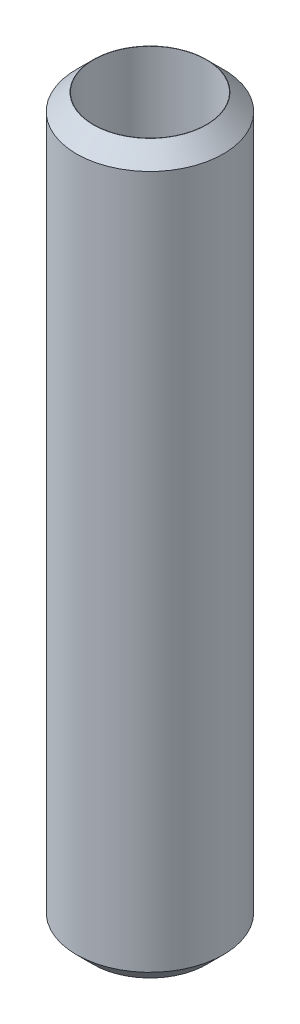
ISO-10303-21;
HEADER;
FILE_DESCRIPTION(('STEP AP214'),'2;1');
FILE_NAME('part.step','',(''),(''),'','','');
FILE_SCHEMA(('AUTOMOTIVE_DESIGN { 1 0 10303 214 1 1 1 1 }'));
ENDSEC;
DATA;
#1=APPLICATION_CONTEXT('core data for automotive mechanical design processes');
#2=APPLICATION_PROTOCOL_DEFINITION('international standard','automotive_design',2000,#1);
#3=PRODUCT_CONTEXT('',#1,'mechanical');
#4=PRODUCT('Part','Part','',(#3));
#5=PRODUCT_RELATED_PRODUCT_CATEGORY('part','',(#4));
#6=PRODUCT_DEFINITION_FORMATION('','',#4);
#7=PRODUCT_DEFINITION_CONTEXT('part definition',#1,'design');
#8=PRODUCT_DEFINITION('design','',#6,#7);
#9=PRODUCT_DEFINITION_SHAPE('','',#8);
#10=(LENGTH_UNIT() NAMED_UNIT(*) SI_UNIT(.MILLI.,.METRE.));
#11=(NAMED_UNIT(*) PLANE_ANGLE_UNIT() SI_UNIT($,.RADIAN.));
#12=(NAMED_UNIT(*) SI_UNIT($,.STERADIAN.) SOLID_ANGLE_UNIT());
#13=UNCERTAINTY_MEASURE_WITH_UNIT(LENGTH_MEASURE(1.E-05),#10,'distance_accuracy_value','');
#14=(GEOMETRIC_REPRESENTATION_CONTEXT(3) GLOBAL_UNCERTAINTY_ASSIGNED_CONTEXT((#13)) GLOBAL_UNIT_ASSIGNED_CONTEXT((#10,
#11,#12)) REPRESENTATION_CONTEXT('',''));
#15=CARTESIAN_POINT('',(0.,0.,0.));
#16=DIRECTION('',(0.,0.,1.));
#17=DIRECTION('',(1.,0.,0.));
#18=AXIS2_PLACEMENT_3D('',#15,#16,#17);
#19=CARTESIAN_POINT('',(0.,173.412976697648,0.));
#20=DIRECTION('',(0.,-1.,0.));
#21=DIRECTION('',(0.,0.,-1.));
#22=AXIS2_PLACEMENT_3D('',#19,#20,#21);
#23=CYLINDRICAL_SURFACE('',#22,17.5);
#24=CARTESIAN_POINT('',(0.,169.405689686538,0.));
#25=DIRECTION('',(0.,1.,0.));
#26=DIRECTION('',(0.,0.,1.));
#27=AXIS2_PLACEMENT_3D('',#24,#25,#26);
#28=CIRCLE('',#27,17.5);
#29=CARTESIAN_POINT('',(0.,169.405689686538,17.5));
#30=VERTEX_POINT('',#29);
#31=EDGE_CURVE('E50',#30,#30,#28,.F.);
#32=ORIENTED_EDGE('',*,*,#31,.T.);
#33=EDGE_LOOP('',(#32));
#34=FACE_BOUND('',#33,.T.);
#35=CARTESIAN_POINT('',(0.,4.00728701110975,0.));
#36=DIRECTION('',(0.,1.,0.));
#37=DIRECTION('',(0.,0.,1.));
#38=AXIS2_PLACEMENT_3D('',#35,#36,#37);
#39=CIRCLE('',#38,17.5);
#40=CARTESIAN_POINT('',(0.,4.00728701110975,17.5));
#41=VERTEX_POINT('',#40);
#42=EDGE_CURVE('E51',#41,#41,#39,.T.);
#43=ORIENTED_EDGE('',*,*,#42,.T.);
#44=EDGE_LOOP('',(#43));
#45=FACE_BOUND('',#44,.T.);
#46=ADVANCED_FACE('F39',(#34,#45),#23,.T.);
#47=CARTESIAN_POINT('',(0.,173.412976697648,0.));
#48=DIRECTION('',(0.,1.,0.));
#49=DIRECTION('',(0.,0.,1.));
#50=AXIS2_PLACEMENT_3D('',#47,#48,#49);
#51=PLANE('',#50);
#52=CARTESIAN_POINT('',(0.,173.412976697648,0.));
#53=DIRECTION('',(0.,1.,0.));
#54=DIRECTION('',(0.,0.,1.));
#55=AXIS2_PLACEMENT_3D('',#52,#53,#54);
#56=CIRCLE('',#55,13.4927129888902);
#57=CARTESIAN_POINT('',(0.,173.412976697648,13.4927129888902));
#58=VERTEX_POINT('',#57);
#59=EDGE_CURVE('E54',#58,#58,#56,.T.);
#60=ORIENTED_EDGE('',*,*,#59,.T.);
#61=EDGE_LOOP('',(#60));
#62=FACE_BOUND('',#61,.T.);
#63=CARTESIAN_POINT('',(0.,173.412976697648,0.));
#64=DIRECTION('',(0.,1.,0.));
#65=DIRECTION('',(0.,0.,1.));
#66=AXIS2_PLACEMENT_3D('',#63,#64,#65);
#67=CIRCLE('',#66,13.42984691783);
#68=CARTESIAN_POINT('',(0.,173.412976697648,13.42984691783));
#69=VERTEX_POINT('',#68);
#70=EDGE_CURVE('E58',#69,#69,#67,.T.);
#71=ORIENTED_EDGE('',*,*,#70,.F.);
#72=EDGE_LOOP('',(#71));
#73=FACE_BOUND('',#72,.T.);
#74=ADVANCED_FACE('F69',(#62,#73),#51,.T.);
#75=CARTESIAN_POINT('',(0.,0.,0.));
#76=DIRECTION('',(0.,1.,0.));
#77=DIRECTION('',(0.,0.,1.));
#78=AXIS2_PLACEMENT_3D('',#75,#76,#77);
#79=PLANE('',#78);
#80=CARTESIAN_POINT('',(0.,0.,0.));
#81=DIRECTION('',(0.,1.,0.));
#82=DIRECTION('',(0.,0.,1.));
#83=AXIS2_PLACEMENT_3D('',#80,#81,#82);
#84=CIRCLE('',#83,13.4927129888902);
#85=CARTESIAN_POINT('',(0.,0.,13.4927129888902));
#86=VERTEX_POINT('',#85);
#87=EDGE_CURVE('E10',#86,#86,#84,.F.);
#88=ORIENTED_EDGE('',*,*,#87,.T.);
#89=EDGE_LOOP('',(#88));
#90=FACE_BOUND('',#89,.T.);
#91=CARTESIAN_POINT('',(0.,0.,0.));
#92=DIRECTION('',(0.,1.,0.));
#93=DIRECTION('',(0.,0.,1.));
#94=AXIS2_PLACEMENT_3D('',#91,#92,#93);
#95=CIRCLE('',#94,13.42984691783);
#96=CARTESIAN_POINT('',(0.,0.,13.42984691783));
#97=VERTEX_POINT('',#96);
#98=EDGE_CURVE('E63',#97,#97,#95,.T.);
#99=ORIENTED_EDGE('',*,*,#98,.T.);
#100=EDGE_LOOP('',(#99));
#101=FACE_BOUND('',#100,.T.);
#102=ADVANCED_FACE('F75',(#90,#101),#79,.F.);
#103=CARTESIAN_POINT('',(0.,173.412976697648,0.));
#104=DIRECTION('',(0.,-1.,0.));
#105=DIRECTION('',(0.,0.,-1.));
#106=AXIS2_PLACEMENT_3D('',#103,#104,#105);
#107=CYLINDRICAL_SURFACE('',#106,13.42984691783);
#108=ORIENTED_EDGE('',*,*,#70,.T.);
#109=EDGE_LOOP('',(#108));
#110=FACE_BOUND('',#109,.T.);
#111=ORIENTED_EDGE('',*,*,#98,.F.);
#112=EDGE_LOOP('',(#111));
#113=FACE_BOUND('',#112,.T.);
#114=ADVANCED_FACE('F70',(#110,#113),#107,.F.);
#115=CARTESIAN_POINT('',(0.,173.412976697648,0.));
#116=DIRECTION('',(0.,-1.,0.));
#117=DIRECTION('',(0.,0.,-1.));
#118=AXIS2_PLACEMENT_3D('',#115,#116,#117);
#119=CONICAL_SURFACE('',#118,13.4927129888902,0.785398163397444);
#120=ORIENTED_EDGE('',*,*,#31,.F.);
#121=EDGE_LOOP('',(#120));
#122=FACE_BOUND('',#121,.T.);
#123=ORIENTED_EDGE('',*,*,#59,.F.);
#124=EDGE_LOOP('',(#123));
#125=FACE_BOUND('',#124,.T.);
#126=ADVANCED_FACE('F81',(#122,#125),#119,.T.);
#127=CARTESIAN_POINT('',(0.,4.00728701110975,0.));
#128=DIRECTION('',(0.,1.,0.));
#129=DIRECTION('',(0.,0.,1.));
#130=AXIS2_PLACEMENT_3D('',#127,#128,#129);
#131=CONICAL_SURFACE('',#130,17.5,0.785398163397452);
#132=ORIENTED_EDGE('',*,*,#87,.F.);
#133=EDGE_LOOP('',(#132));
#134=FACE_BOUND('',#133,.T.);
#135=ORIENTED_EDGE('',*,*,#42,.F.);
#136=EDGE_LOOP('',(#135));
#137=FACE_BOUND('',#136,.T.);
#138=ADVANCED_FACE('F45',(#134,#137),#131,.T.);
#139=CLOSED_SHELL('',(#46,#74,#102,#114,#126,#138));
#140=MANIFOLD_SOLID_BREP('B2',#139);
#141=ADVANCED_BREP_SHAPE_REPRESENTATION('',(#18,#140),#14);
#142=SHAPE_DEFINITION_REPRESENTATION(#9,#141);
ENDSEC;
END-ISO-10303-21;
